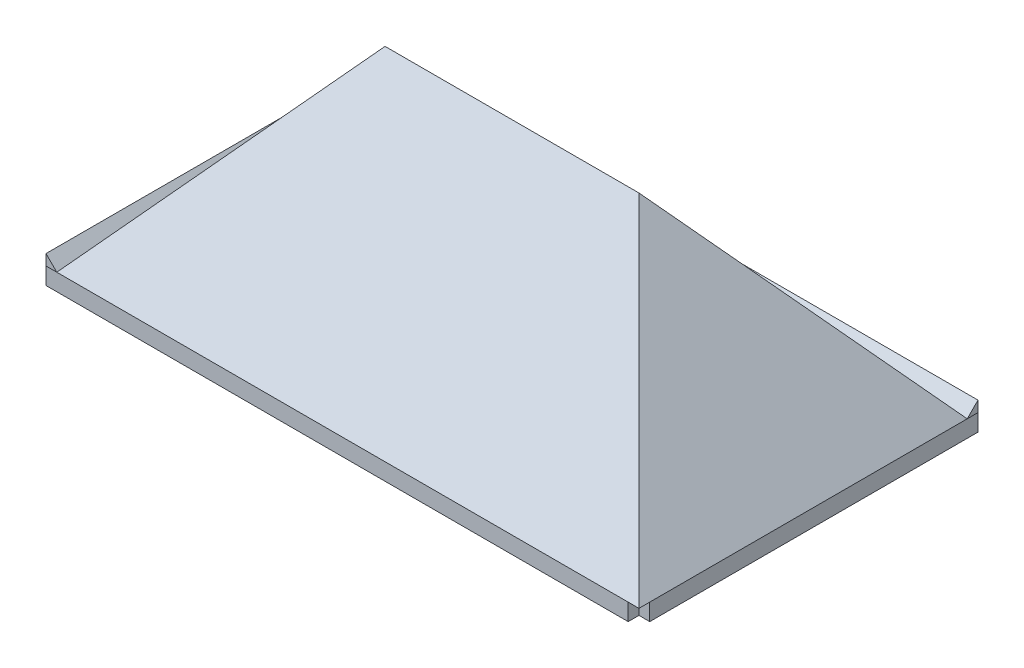
ISO-10303-21;
HEADER;
FILE_DESCRIPTION(('STEP AP214'),'2;1');
FILE_NAME('part.step','',(''),(''),'','','');
FILE_SCHEMA(('AUTOMOTIVE_DESIGN { 1 0 10303 214 1 1 1 1 }'));
ENDSEC;
DATA;
#1=APPLICATION_CONTEXT('core data for automotive mechanical design processes');
#2=APPLICATION_PROTOCOL_DEFINITION('international standard','automotive_design',2000,#1);
#3=PRODUCT_CONTEXT('',#1,'mechanical');
#4=PRODUCT('Part','Part','',(#3));
#5=PRODUCT_RELATED_PRODUCT_CATEGORY('part','',(#4));
#6=PRODUCT_DEFINITION_FORMATION('','',#4);
#7=PRODUCT_DEFINITION_CONTEXT('part definition',#1,'design');
#8=PRODUCT_DEFINITION('design','',#6,#7);
#9=PRODUCT_DEFINITION_SHAPE('','',#8);
#10=(LENGTH_UNIT() NAMED_UNIT(*) SI_UNIT(.MILLI.,.METRE.));
#11=(NAMED_UNIT(*) PLANE_ANGLE_UNIT() SI_UNIT($,.RADIAN.));
#12=(NAMED_UNIT(*) SI_UNIT($,.STERADIAN.) SOLID_ANGLE_UNIT());
#13=UNCERTAINTY_MEASURE_WITH_UNIT(LENGTH_MEASURE(1.E-05),#10,'distance_accuracy_value','');
#14=(GEOMETRIC_REPRESENTATION_CONTEXT(3) GLOBAL_UNCERTAINTY_ASSIGNED_CONTEXT((#13)) GLOBAL_UNIT_ASSIGNED_CONTEXT((#10,
#11,#12)) REPRESENTATION_CONTEXT('',''));
#15=CARTESIAN_POINT('',(0.,0.,0.));
#16=DIRECTION('',(0.,0.,1.));
#17=DIRECTION('',(1.,0.,0.));
#18=AXIS2_PLACEMENT_3D('',#15,#16,#17);
#19=CARTESIAN_POINT('',(105.,0.,120.));
#20=DIRECTION('',(0.,1.,0.));
#21=DIRECTION('',(-1.,0.,0.));
#22=AXIS2_PLACEMENT_3D('',#19,#20,#21);
#23=PLANE('',#22);
#24=DIRECTION('',(1.,0.,0.));
#25=VECTOR('',#24,1.);
#26=CARTESIAN_POINT('',(105.,0.,5.2216291573291));
#27=LINE('',#26,#25);
#28=CARTESIAN_POINT('',(-99.7783708426709,0.,5.2216291573291));
#29=VERTEX_POINT('',#28);
#30=CARTESIAN_POINT('',(99.7783708426709,0.,5.2216291573291));
#31=VERTEX_POINT('',#30);
#32=EDGE_CURVE('E195',#29,#31,#27,.T.);
#33=ORIENTED_EDGE('',*,*,#32,.F.);
#34=DIRECTION('',(0.,0.,-1.));
#35=VECTOR('',#34,1.);
#36=CARTESIAN_POINT('',(-99.7783708426709,0.,120.));
#37=LINE('',#36,#35);
#38=CARTESIAN_POINT('',(-99.7783708426709,0.,114.778370842671));
#39=VERTEX_POINT('',#38);
#40=EDGE_CURVE('E205',#39,#29,#37,.T.);
#41=ORIENTED_EDGE('',*,*,#40,.F.);
#42=DIRECTION('',(1.,0.,0.));
#43=VECTOR('',#42,1.);
#44=CARTESIAN_POINT('',(-150.,0.,114.778370842671));
#45=LINE('',#44,#43);
#46=CARTESIAN_POINT('',(99.7783708426709,0.,114.778370842671));
#47=VERTEX_POINT('',#46);
#48=EDGE_CURVE('E206',#39,#47,#45,.T.);
#49=ORIENTED_EDGE('',*,*,#48,.T.);
#50=DIRECTION('',(0.,0.,-1.));
#51=VECTOR('',#50,1.);
#52=CARTESIAN_POINT('',(99.7783708426709,0.,120.));
#53=LINE('',#52,#51);
#54=EDGE_CURVE('E201',#47,#31,#53,.T.);
#55=ORIENTED_EDGE('',*,*,#54,.T.);
#56=EDGE_LOOP('',(#33,#41,#49,#55));
#57=FACE_BOUND('',#56,.T.);
#58=DIRECTION('',(0.,0.,-1.));
#59=VECTOR('',#58,1.);
#60=CARTESIAN_POINT('',(-103.174977327052,0.,122.));
#61=LINE('',#60,#59);
#62=CARTESIAN_POINT('',(-103.174977327052,0.,122.));
#63=VERTEX_POINT('',#62);
#64=CARTESIAN_POINT('',(-103.174977327052,0.,118.174977327052));
#65=VERTEX_POINT('',#64);
#66=EDGE_CURVE('E47',#63,#65,#61,.T.);
#67=ORIENTED_EDGE('',*,*,#66,.T.);
#68=DIRECTION('',(-1.,0.,0.));
#69=VECTOR('',#68,1.);
#70=CARTESIAN_POINT('',(-107.,0.,118.174977327052));
#71=LINE('',#70,#69);
#72=CARTESIAN_POINT('',(-107.,0.,118.174977327052));
#73=VERTEX_POINT('',#72);
#74=EDGE_CURVE('E313',#65,#73,#71,.T.);
#75=ORIENTED_EDGE('',*,*,#74,.T.);
#76=DIRECTION('',(0.,0.,-1.));
#77=VECTOR('',#76,1.);
#78=CARTESIAN_POINT('',(-107.,0.,4.));
#79=LINE('',#78,#77);
#80=CARTESIAN_POINT('',(-107.,0.,1.82502267294814));
#81=VERTEX_POINT('',#80);
#82=EDGE_CURVE('E179',#73,#81,#79,.T.);
#83=ORIENTED_EDGE('',*,*,#82,.T.);
#84=DIRECTION('',(1.,0.,0.));
#85=VECTOR('',#84,1.);
#86=CARTESIAN_POINT('',(-107.,0.,1.82502267294814));
#87=LINE('',#86,#85);
#88=CARTESIAN_POINT('',(-103.174977327052,0.,1.82502267294814));
#89=VERTEX_POINT('',#88);
#90=EDGE_CURVE('E281',#81,#89,#87,.T.);
#91=ORIENTED_EDGE('',*,*,#90,.T.);
#92=DIRECTION('',(0.,0.,-1.));
#93=VECTOR('',#92,1.);
#94=CARTESIAN_POINT('',(-103.174977327052,0.,-2.));
#95=LINE('',#94,#93);
#96=CARTESIAN_POINT('',(-103.174977327052,0.,-2.));
#97=VERTEX_POINT('',#96);
#98=EDGE_CURVE('E278',#89,#97,#95,.T.);
#99=ORIENTED_EDGE('',*,*,#98,.T.);
#100=DIRECTION('',(1.,0.,0.));
#101=VECTOR('',#100,1.);
#102=CARTESIAN_POINT('',(-107.,0.,-2.));
#103=LINE('',#102,#101);
#104=CARTESIAN_POINT('',(103.174977327052,0.,-2.));
#105=VERTEX_POINT('',#104);
#106=EDGE_CURVE('E181',#97,#105,#103,.T.);
#107=ORIENTED_EDGE('',*,*,#106,.T.);
#108=DIRECTION('',(0.,0.,1.));
#109=VECTOR('',#108,1.);
#110=CARTESIAN_POINT('',(103.174977327052,0.,-2.));
#111=LINE('',#110,#109);
#112=CARTESIAN_POINT('',(103.174977327052,0.,1.82502267294814));
#113=VERTEX_POINT('',#112);
#114=EDGE_CURVE('E298',#105,#113,#111,.T.);
#115=ORIENTED_EDGE('',*,*,#114,.T.);
#116=DIRECTION('',(1.,0.,0.));
#117=VECTOR('',#116,1.);
#118=CARTESIAN_POINT('',(107.,0.,1.82502267294814));
#119=LINE('',#118,#117);
#120=CARTESIAN_POINT('',(107.,0.,1.82502267294814));
#121=VERTEX_POINT('',#120);
#122=EDGE_CURVE('E295',#113,#121,#119,.T.);
#123=ORIENTED_EDGE('',*,*,#122,.T.);
#124=DIRECTION('',(0.,0.,-1.));
#125=VECTOR('',#124,1.);
#126=CARTESIAN_POINT('',(107.,0.,4.));
#127=LINE('',#126,#125);
#128=CARTESIAN_POINT('',(107.,0.,118.174977327052));
#129=VERTEX_POINT('',#128);
#130=EDGE_CURVE('E171',#129,#121,#127,.T.);
#131=ORIENTED_EDGE('',*,*,#130,.F.);
#132=DIRECTION('',(-1.,0.,0.));
#133=VECTOR('',#132,1.);
#134=CARTESIAN_POINT('',(107.,0.,118.174977327052));
#135=LINE('',#134,#133);
#136=CARTESIAN_POINT('',(103.174977327052,0.,118.174977327052));
#137=VERTEX_POINT('',#136);
#138=EDGE_CURVE('E290',#129,#137,#135,.T.);
#139=ORIENTED_EDGE('',*,*,#138,.T.);
#140=DIRECTION('',(0.,0.,1.));
#141=VECTOR('',#140,1.);
#142=CARTESIAN_POINT('',(103.174977327052,0.,122.));
#143=LINE('',#142,#141);
#144=CARTESIAN_POINT('',(103.174977327052,0.,122.));
#145=VERTEX_POINT('',#144);
#146=EDGE_CURVE('E305',#137,#145,#143,.T.);
#147=ORIENTED_EDGE('',*,*,#146,.T.);
#148=DIRECTION('',(1.,0.,0.));
#149=VECTOR('',#148,1.);
#150=CARTESIAN_POINT('',(-107.,0.,122.));
#151=LINE('',#150,#149);
#152=EDGE_CURVE('E168',#63,#145,#151,.T.);
#153=ORIENTED_EDGE('',*,*,#152,.F.);
#154=EDGE_LOOP('',(#67,#75,#83,#91,#99,#107,#115,#123,#131,#139,#147,#153));
#155=FACE_BOUND('',#154,.T.);
#156=ADVANCED_FACE('F33',(#57,#155),#23,.F.);
#157=CARTESIAN_POINT('',(-107.,6.,-2.));
#158=DIRECTION('',(0.,0.707106781186547,0.707106781186547));
#159=DIRECTION('',(0.,-0.707106781186548,0.707106781186548));
#160=AXIS2_PLACEMENT_3D('',#157,#158,#159);
#161=PLANE('',#160);
#162=DIRECTION('',(-1.,0.,0.));
#163=VECTOR('',#162,1.);
#164=CARTESIAN_POINT('',(-150.,2.17497732705187,1.82502267294814));
#165=LINE('',#164,#163);
#166=CARTESIAN_POINT('',(103.174977327052,2.17497732705185,1.82502267294814));
#167=VERTEX_POINT('',#166);
#168=CARTESIAN_POINT('',(-103.174977327052,2.1749773270518,1.82502267294814));
#169=VERTEX_POINT('',#168);
#170=EDGE_CURVE('E225',#167,#169,#165,.T.);
#171=ORIENTED_EDGE('',*,*,#170,.F.);
#172=DIRECTION('',(0.,0.707106781186548,-0.707106781186548));
#173=VECTOR('',#172,1.);
#174=CARTESIAN_POINT('',(103.174977327052,6.,-2.));
#175=LINE('',#174,#173);
#176=CARTESIAN_POINT('',(103.174977327052,6.,-2.));
#177=VERTEX_POINT('',#176);
#178=EDGE_CURVE('E150',#167,#177,#175,.T.);
#179=ORIENTED_EDGE('',*,*,#178,.T.);
#180=DIRECTION('',(1.,0.,0.));
#181=VECTOR('',#180,1.);
#182=CARTESIAN_POINT('',(-107.,6.,-2.));
#183=LINE('',#182,#181);
#184=CARTESIAN_POINT('',(-103.174977327052,6.,-2.));
#185=VERTEX_POINT('',#184);
#186=EDGE_CURVE('E182',#185,#177,#183,.T.);
#187=ORIENTED_EDGE('',*,*,#186,.F.);
#188=DIRECTION('',(0.,-0.707106781186548,0.707106781186548));
#189=VECTOR('',#188,1.);
#190=CARTESIAN_POINT('',(-103.174977327052,6.,-2.));
#191=LINE('',#190,#189);
#192=EDGE_CURVE('E250',#185,#169,#191,.T.);
#193=ORIENTED_EDGE('',*,*,#192,.T.);
#194=EDGE_LOOP('',(#171,#179,#187,#193));
#195=FACE_BOUND('',#194,.T.);
#196=ADVANCED_FACE('F247',(#195),#161,.T.);
#197=CARTESIAN_POINT('',(-107.,0.,-2.));
#198=DIRECTION('',(0.,0.,-1.));
#199=DIRECTION('',(0.,1.,0.));
#200=AXIS2_PLACEMENT_3D('',#197,#198,#199);
#201=PLANE('',#200);
#202=ORIENTED_EDGE('',*,*,#186,.T.);
#203=DIRECTION('',(0.,-1.,0.));
#204=VECTOR('',#203,1.);
#205=CARTESIAN_POINT('',(103.174977327052,6.,-2.));
#206=LINE('',#205,#204);
#207=EDGE_CURVE('E287',#177,#105,#206,.T.);
#208=ORIENTED_EDGE('',*,*,#207,.T.);
#209=ORIENTED_EDGE('',*,*,#106,.F.);
#210=DIRECTION('',(0.,-1.,0.));
#211=VECTOR('',#210,1.);
#212=CARTESIAN_POINT('',(-103.174977327052,6.,-2.));
#213=LINE('',#212,#211);
#214=EDGE_CURVE('E276',#185,#97,#213,.T.);
#215=ORIENTED_EDGE('',*,*,#214,.F.);
#216=EDGE_LOOP('',(#202,#208,#209,#215));
#217=FACE_BOUND('',#216,.T.);
#218=ADVANCED_FACE('F333',(#217),#201,.T.);
#219=CARTESIAN_POINT('',(-107.,0.,0.));
#220=DIRECTION('',(1.,0.,0.));
#221=DIRECTION('',(0.,0.,-1.));
#222=AXIS2_PLACEMENT_3D('',#219,#220,#221);
#223=PLANE('',#222);
#224=DIRECTION('',(0.,-1.,0.));
#225=VECTOR('',#224,1.);
#226=CARTESIAN_POINT('',(-107.,6.,118.174977327052));
#227=LINE('',#226,#225);
#228=CARTESIAN_POINT('',(-107.,6.,118.174977327052));
#229=VERTEX_POINT('',#228);
#230=EDGE_CURVE('E311',#229,#73,#227,.T.);
#231=ORIENTED_EDGE('',*,*,#230,.F.);
#232=DIRECTION('',(0.,0.,1.));
#233=VECTOR('',#232,1.);
#234=CARTESIAN_POINT('',(-107.,5.99999999999999,-2.));
#235=LINE('',#234,#233);
#236=CARTESIAN_POINT('',(-107.,5.99999999999999,1.82502267294814));
#237=VERTEX_POINT('',#236);
#238=EDGE_CURVE('E264',#237,#229,#235,.T.);
#239=ORIENTED_EDGE('',*,*,#238,.F.);
#240=DIRECTION('',(0.,-1.,0.));
#241=VECTOR('',#240,1.);
#242=CARTESIAN_POINT('',(-107.,6.,1.82502267294814));
#243=LINE('',#242,#241);
#244=EDGE_CURVE('E271',#237,#81,#243,.T.);
#245=ORIENTED_EDGE('',*,*,#244,.T.);
#246=ORIENTED_EDGE('',*,*,#82,.F.);
#247=EDGE_LOOP('',(#231,#239,#245,#246));
#248=FACE_BOUND('',#247,.T.);
#249=ADVANCED_FACE('F345',(#248),#223,.F.);
#250=CARTESIAN_POINT('',(-107.,5.99999999999999,-2.));
#251=DIRECTION('',(0.707106781186547,0.707106781186548,0.));
#252=DIRECTION('',(-0.707106781186548,0.707106781186547,0.));
#253=AXIS2_PLACEMENT_3D('',#250,#251,#252);
#254=PLANE('',#253);
#255=ORIENTED_EDGE('',*,*,#238,.T.);
#256=DIRECTION('',(0.707106781186548,-0.707106781186547,0.));
#257=VECTOR('',#256,1.);
#258=CARTESIAN_POINT('',(-107.,5.99999999999999,118.174977327052));
#259=LINE('',#258,#257);
#260=CARTESIAN_POINT('',(-103.174977327052,2.17497732705182,118.174977327052));
#261=VERTEX_POINT('',#260);
#262=EDGE_CURVE('E162',#229,#261,#259,.T.);
#263=ORIENTED_EDGE('',*,*,#262,.T.);
#264=DIRECTION('',(0.,0.,1.));
#265=VECTOR('',#264,1.);
#266=CARTESIAN_POINT('',(-103.174977327052,2.17497732705183,120.));
#267=LINE('',#266,#265);
#268=EDGE_CURVE('E261',#169,#261,#267,.T.);
#269=ORIENTED_EDGE('',*,*,#268,.F.);
#270=DIRECTION('',(-0.707106781186548,0.707106781186547,0.));
#271=VECTOR('',#270,1.);
#272=CARTESIAN_POINT('',(-107.,5.99999999999999,1.82502267294814));
#273=LINE('',#272,#271);
#274=EDGE_CURVE('E229',#169,#237,#273,.T.);
#275=ORIENTED_EDGE('',*,*,#274,.T.);
#276=EDGE_LOOP('',(#255,#263,#269,#275));
#277=FACE_BOUND('',#276,.T.);
#278=ADVANCED_FACE('F346',(#277),#254,.T.);
#279=CARTESIAN_POINT('',(107.,0.,0.));
#280=DIRECTION('',(1.,0.,0.));
#281=DIRECTION('',(0.,0.,-1.));
#282=AXIS2_PLACEMENT_3D('',#279,#280,#281);
#283=PLANE('',#282);
#284=DIRECTION('',(0.,0.,1.));
#285=VECTOR('',#284,1.);
#286=CARTESIAN_POINT('',(107.,6.,-2.));
#287=LINE('',#286,#285);
#288=CARTESIAN_POINT('',(107.,6.,1.82502267294814));
#289=VERTEX_POINT('',#288);
#290=CARTESIAN_POINT('',(107.,6.,118.174977327052));
#291=VERTEX_POINT('',#290);
#292=EDGE_CURVE('E174',#289,#291,#287,.T.);
#293=ORIENTED_EDGE('',*,*,#292,.T.);
#294=DIRECTION('',(0.,-1.,0.));
#295=VECTOR('',#294,1.);
#296=CARTESIAN_POINT('',(107.,6.,118.174977327052));
#297=LINE('',#296,#295);
#298=EDGE_CURVE('E55',#291,#129,#297,.T.);
#299=ORIENTED_EDGE('',*,*,#298,.T.);
#300=ORIENTED_EDGE('',*,*,#130,.T.);
#301=DIRECTION('',(0.,-1.,0.));
#302=VECTOR('',#301,1.);
#303=CARTESIAN_POINT('',(107.,6.,1.82502267294814));
#304=LINE('',#303,#302);
#305=EDGE_CURVE('E293',#289,#121,#304,.T.);
#306=ORIENTED_EDGE('',*,*,#305,.F.);
#307=EDGE_LOOP('',(#293,#299,#300,#306));
#308=FACE_BOUND('',#307,.T.);
#309=ADVANCED_FACE('F326',(#308),#283,.T.);
#310=CARTESIAN_POINT('',(-107.,0.,116.));
#311=DIRECTION('',(0.,0.707106781186548,-0.707106781186547));
#312=DIRECTION('',(0.,0.707106781186547,0.707106781186548));
#313=AXIS2_PLACEMENT_3D('',#310,#311,#312);
#314=PLANE('',#313);
#315=DIRECTION('',(1.,0.,0.));
#316=VECTOR('',#315,1.);
#317=CARTESIAN_POINT('',(-150.,2.17497732705185,118.174977327052));
#318=LINE('',#317,#316);
#319=CARTESIAN_POINT('',(103.174977327052,2.17497732705188,118.174977327052));
#320=VERTEX_POINT('',#319);
#321=EDGE_CURVE('E160',#261,#320,#318,.T.);
#322=ORIENTED_EDGE('',*,*,#321,.F.);
#323=DIRECTION('',(0.,0.707106781186547,0.707106781186548));
#324=VECTOR('',#323,1.);
#325=CARTESIAN_POINT('',(-103.174977327052,0.,116.));
#326=LINE('',#325,#324);
#327=CARTESIAN_POINT('',(-103.174977327052,6.,122.));
#328=VERTEX_POINT('',#327);
#329=EDGE_CURVE('E144',#261,#328,#326,.T.);
#330=ORIENTED_EDGE('',*,*,#329,.T.);
#331=DIRECTION('',(1.,0.,0.));
#332=VECTOR('',#331,1.);
#333=CARTESIAN_POINT('',(-107.,5.99999999999999,122.));
#334=LINE('',#333,#332);
#335=CARTESIAN_POINT('',(103.174977327052,6.,122.));
#336=VERTEX_POINT('',#335);
#337=EDGE_CURVE('E158',#328,#336,#334,.T.);
#338=ORIENTED_EDGE('',*,*,#337,.T.);
#339=DIRECTION('',(0.,-0.707106781186547,-0.707106781186548));
#340=VECTOR('',#339,1.);
#341=CARTESIAN_POINT('',(103.174977327052,0.,116.));
#342=LINE('',#341,#340);
#343=EDGE_CURVE('E163',#336,#320,#342,.T.);
#344=ORIENTED_EDGE('',*,*,#343,.T.);
#345=EDGE_LOOP('',(#322,#330,#338,#344));
#346=FACE_BOUND('',#345,.T.);
#347=ADVANCED_FACE('F156',(#346),#314,.T.);
#348=CARTESIAN_POINT('',(-107.,0.,122.));
#349=DIRECTION('',(0.,0.,1.));
#350=DIRECTION('',(1.,0.,0.));
#351=AXIS2_PLACEMENT_3D('',#348,#349,#350);
#352=PLANE('',#351);
#353=ORIENTED_EDGE('',*,*,#337,.F.);
#354=DIRECTION('',(0.,-1.,0.));
#355=VECTOR('',#354,1.);
#356=CARTESIAN_POINT('',(-103.174977327052,6.,122.));
#357=LINE('',#356,#355);
#358=EDGE_CURVE('E141',#328,#63,#357,.T.);
#359=ORIENTED_EDGE('',*,*,#358,.T.);
#360=ORIENTED_EDGE('',*,*,#152,.T.);
#361=DIRECTION('',(0.,-1.,0.));
#362=VECTOR('',#361,1.);
#363=CARTESIAN_POINT('',(103.174977327052,6.,122.));
#364=LINE('',#363,#362);
#365=EDGE_CURVE('E167',#336,#145,#364,.T.);
#366=ORIENTED_EDGE('',*,*,#365,.F.);
#367=EDGE_LOOP('',(#353,#359,#360,#366));
#368=FACE_BOUND('',#367,.T.);
#369=ADVANCED_FACE('F166',(#368),#352,.T.);
#370=CARTESIAN_POINT('',(107.,6.,-2.));
#371=DIRECTION('',(-0.707106781186547,0.707106781186548,0.));
#372=DIRECTION('',(-0.707106781186548,-0.707106781186547,0.));
#373=AXIS2_PLACEMENT_3D('',#370,#371,#372);
#374=PLANE('',#373);
#375=DIRECTION('',(0.,0.,-1.));
#376=VECTOR('',#375,1.);
#377=CARTESIAN_POINT('',(103.174977327052,2.17497732705185,120.));
#378=LINE('',#377,#376);
#379=EDGE_CURVE('E169',#320,#167,#378,.T.);
#380=ORIENTED_EDGE('',*,*,#379,.F.);
#381=DIRECTION('',(0.707106781186548,0.707106781186547,0.));
#382=VECTOR('',#381,1.);
#383=CARTESIAN_POINT('',(107.,6.,118.174977327052));
#384=LINE('',#383,#382);
#385=EDGE_CURVE('E11',#320,#291,#384,.T.);
#386=ORIENTED_EDGE('',*,*,#385,.T.);
#387=ORIENTED_EDGE('',*,*,#292,.F.);
#388=DIRECTION('',(-0.707106781186548,-0.707106781186547,0.));
#389=VECTOR('',#388,1.);
#390=CARTESIAN_POINT('',(107.,6.,1.82502267294814));
#391=LINE('',#390,#389);
#392=EDGE_CURVE('E40',#289,#167,#391,.T.);
#393=ORIENTED_EDGE('',*,*,#392,.T.);
#394=EDGE_LOOP('',(#380,#386,#387,#393));
#395=FACE_BOUND('',#394,.T.);
#396=ADVANCED_FACE('F235',(#395),#374,.T.);
#397=CARTESIAN_POINT('',(0.,125.134127222392,120.));
#398=DIRECTION('',(-0.766044443118977,-0.64278760968654,0.));
#399=DIRECTION('',(0.64278760968654,-0.766044443118977,0.));
#400=AXIS2_PLACEMENT_3D('',#397,#398,#399);
#401=PLANE('',#400);
#402=DIRECTION('',(0.54071620306094,-0.644400477571773,0.540716203060932));
#403=VECTOR('',#402,1.);
#404=CARTESIAN_POINT('',(30.6992712865262,88.5481603766499,45.6992712865273));
#405=LINE('',#404,#403);
#406=CARTESIAN_POINT('',(44.9999999999991,71.5052155556534,60.));
#407=VERTEX_POINT('',#406);
#408=EDGE_CURVE('E222',#407,#320,#405,.T.);
#409=ORIENTED_EDGE('',*,*,#408,.T.);
#410=ORIENTED_EDGE('',*,*,#379,.T.);
#411=DIRECTION('',(-0.54071620306094,0.644400477571773,0.540716203060932));
#412=VECTOR('',#411,1.);
#413=CARTESIAN_POINT('',(-4.38561018378998,130.360693914641,109.385610183788));
#414=LINE('',#413,#412);
#415=EDGE_CURVE('E218',#167,#407,#414,.T.);
#416=ORIENTED_EDGE('',*,*,#415,.T.);
#417=EDGE_LOOP('',(#409,#410,#416));
#418=FACE_BOUND('',#417,.T.);
#419=ADVANCED_FACE('F241',(#418),#401,.F.);
#420=CARTESIAN_POINT('',(-105.,0.,120.));
#421=DIRECTION('',(0.766044443118977,-0.64278760968654,0.));
#422=DIRECTION('',(0.64278760968654,0.766044443118977,0.));
#423=AXIS2_PLACEMENT_3D('',#420,#421,#422);
#424=PLANE('',#423);
#425=DIRECTION('',(-0.54071620306094,-0.644400477571773,-0.540716203060932));
#426=VECTOR('',#425,1.);
#427=CARTESIAN_POINT('',(-69.9151185296838,41.8125335379913,35.0848814703157));
#428=LINE('',#427,#426);
#429=CARTESIAN_POINT('',(-44.9999999999991,71.5052155556534,60.));
#430=VERTEX_POINT('',#429);
#431=EDGE_CURVE('E215',#430,#169,#428,.T.);
#432=ORIENTED_EDGE('',*,*,#431,.T.);
#433=ORIENTED_EDGE('',*,*,#268,.T.);
#434=DIRECTION('',(0.54071620306094,0.644400477571773,-0.540716203060932));
#435=VECTOR('',#434,1.);
#436=CARTESIAN_POINT('',(-105.,0.,120.));
#437=LINE('',#436,#435);
#438=EDGE_CURVE('E220',#261,#430,#437,.T.);
#439=ORIENTED_EDGE('',*,*,#438,.T.);
#440=EDGE_LOOP('',(#432,#433,#439));
#441=FACE_BOUND('',#440,.T.);
#442=ADVANCED_FACE('F259',(#441),#424,.F.);
#443=CARTESIAN_POINT('',(-150.,0.,120.));
#444=DIRECTION('',(0.,-0.642787609686535,-0.766044443118982));
#445=DIRECTION('',(0.,0.766044443118982,-0.642787609686535));
#446=AXIS2_PLACEMENT_3D('',#443,#444,#445);
#447=PLANE('',#446);
#448=ORIENTED_EDGE('',*,*,#438,.F.);
#449=ORIENTED_EDGE('',*,*,#321,.T.);
#450=ORIENTED_EDGE('',*,*,#408,.F.);
#451=DIRECTION('',(1.,0.,0.));
#452=VECTOR('',#451,1.);
#453=CARTESIAN_POINT('',(-150.,71.5052155556534,60.));
#454=LINE('',#453,#452);
#455=EDGE_CURVE('E204',#430,#407,#454,.T.);
#456=ORIENTED_EDGE('',*,*,#455,.F.);
#457=EDGE_LOOP('',(#448,#449,#450,#456));
#458=FACE_BOUND('',#457,.T.);
#459=ADVANCED_FACE('F257',(#458),#447,.F.);
#460=CARTESIAN_POINT('',(-150.,71.5052155556534,60.));
#461=DIRECTION('',(0.,-0.642787609686535,0.766044443118982));
#462=DIRECTION('',(0.,-0.766044443118982,-0.642787609686535));
#463=AXIS2_PLACEMENT_3D('',#460,#461,#462);
#464=PLANE('',#463);
#465=ORIENTED_EDGE('',*,*,#415,.F.);
#466=ORIENTED_EDGE('',*,*,#170,.T.);
#467=ORIENTED_EDGE('',*,*,#431,.F.);
#468=ORIENTED_EDGE('',*,*,#455,.T.);
#469=EDGE_LOOP('',(#465,#466,#467,#468));
#470=FACE_BOUND('',#469,.T.);
#471=ADVANCED_FACE('F253',(#470),#464,.F.);
#472=CARTESIAN_POINT('',(-3.06417777247592,122.562976783646,120.));
#473=DIRECTION('',(-0.766044443118977,-0.64278760968654,0.));
#474=DIRECTION('',(0.64278760968654,-0.766044443118977,0.));
#475=AXIS2_PLACEMENT_3D('',#472,#473,#474);
#476=PLANE('',#475);
#477=ORIENTED_EDGE('',*,*,#54,.F.);
#478=DIRECTION('',(0.54071620306094,-0.644400477571773,0.540716203060932));
#479=VECTOR('',#478,1.);
#480=CARTESIAN_POINT('',(28.5309794636444,84.9093346389202,43.5309794636455));
#481=LINE('',#480,#479);
#482=CARTESIAN_POINT('',(44.9999999999992,65.2823202482117,60.));
#483=VERTEX_POINT('',#482);
#484=EDGE_CURVE('E193',#483,#47,#481,.T.);
#485=ORIENTED_EDGE('',*,*,#484,.F.);
#486=DIRECTION('',(-0.54071620306094,0.644400477571773,0.540716203060932));
#487=VECTOR('',#486,1.);
#488=CARTESIAN_POINT('',(-6.55390200667176,126.721868176911,111.55390200667));
#489=LINE('',#488,#487);
#490=EDGE_CURVE('E188',#31,#483,#489,.T.);
#491=ORIENTED_EDGE('',*,*,#490,.F.);
#492=EDGE_LOOP('',(#477,#485,#491));
#493=FACE_BOUND('',#492,.T.);
#494=ADVANCED_FACE('F374',(#493),#476,.T.);
#495=CARTESIAN_POINT('',(-101.935822227524,-2.57115043874617,120.));
#496=DIRECTION('',(0.766044443118977,-0.64278760968654,0.));
#497=DIRECTION('',(0.64278760968654,0.766044443118977,0.));
#498=AXIS2_PLACEMENT_3D('',#495,#496,#497);
#499=PLANE('',#498);
#500=DIRECTION('',(0.54071620306094,0.644400477571773,-0.540716203060932));
#501=VECTOR('',#500,1.);
#502=CARTESIAN_POINT('',(-102.831708177118,-3.63882573772964,117.831708177118));
#503=LINE('',#502,#501);
#504=CARTESIAN_POINT('',(-44.9999999999992,65.2823202482117,60.));
#505=VERTEX_POINT('',#504);
#506=EDGE_CURVE('E191',#39,#505,#503,.T.);
#507=ORIENTED_EDGE('',*,*,#506,.F.);
#508=ORIENTED_EDGE('',*,*,#40,.T.);
#509=DIRECTION('',(-0.54071620306094,-0.644400477571773,-0.540716203060932));
#510=VECTOR('',#509,1.);
#511=CARTESIAN_POINT('',(-67.746826706802,38.1737078002616,37.2531732931975));
#512=LINE('',#511,#510);
#513=EDGE_CURVE('E192',#505,#29,#512,.T.);
#514=ORIENTED_EDGE('',*,*,#513,.F.);
#515=EDGE_LOOP('',(#507,#508,#514));
#516=FACE_BOUND('',#515,.T.);
#517=ADVANCED_FACE('F370',(#516),#499,.T.);
#518=CARTESIAN_POINT('',(-150.,-2.57115043874614,116.935822227524));
#519=DIRECTION('',(0.,-0.642787609686535,-0.766044443118982));
#520=DIRECTION('',(0.,0.766044443118982,-0.642787609686535));
#521=AXIS2_PLACEMENT_3D('',#518,#519,#520);
#522=PLANE('',#521);
#523=DIRECTION('',(1.,0.,0.));
#524=VECTOR('',#523,1.);
#525=CARTESIAN_POINT('',(-150.,65.2823202482117,60.));
#526=LINE('',#525,#524);
#527=EDGE_CURVE('E185',#505,#483,#526,.T.);
#528=ORIENTED_EDGE('',*,*,#527,.T.);
#529=ORIENTED_EDGE('',*,*,#484,.T.);
#530=ORIENTED_EDGE('',*,*,#48,.F.);
#531=ORIENTED_EDGE('',*,*,#506,.T.);
#532=EDGE_LOOP('',(#528,#529,#530,#531));
#533=FACE_BOUND('',#532,.T.);
#534=ADVANCED_FACE('F372',(#533),#522,.T.);
#535=CARTESIAN_POINT('',(-150.,68.9340651169073,63.0641777724759));
#536=DIRECTION('',(0.,-0.642787609686535,0.766044443118982));
#537=DIRECTION('',(0.,-0.766044443118982,-0.642787609686535));
#538=AXIS2_PLACEMENT_3D('',#535,#536,#537);
#539=PLANE('',#538);
#540=ORIENTED_EDGE('',*,*,#32,.T.);
#541=ORIENTED_EDGE('',*,*,#490,.T.);
#542=ORIENTED_EDGE('',*,*,#527,.F.);
#543=ORIENTED_EDGE('',*,*,#513,.T.);
#544=EDGE_LOOP('',(#540,#541,#542,#543));
#545=FACE_BOUND('',#544,.T.);
#546=ADVANCED_FACE('F366',(#545),#539,.T.);
#547=CARTESIAN_POINT('',(-107.,6.,1.82502267294814));
#548=DIRECTION('',(0.,0.,-1.));
#549=DIRECTION('',(-1.,0.,0.));
#550=AXIS2_PLACEMENT_3D('',#547,#548,#549);
#551=PLANE('',#550);
#552=DIRECTION('',(0.,-1.,0.));
#553=VECTOR('',#552,1.);
#554=CARTESIAN_POINT('',(-103.174977327052,6.,1.82502267294814));
#555=LINE('',#554,#553);
#556=EDGE_CURVE('E274',#169,#89,#555,.T.);
#557=ORIENTED_EDGE('',*,*,#556,.T.);
#558=ORIENTED_EDGE('',*,*,#90,.F.);
#559=ORIENTED_EDGE('',*,*,#244,.F.);
#560=ORIENTED_EDGE('',*,*,#274,.F.);
#561=EDGE_LOOP('',(#557,#558,#559,#560));
#562=FACE_BOUND('',#561,.T.);
#563=ADVANCED_FACE('F341',(#562),#551,.T.);
#564=CARTESIAN_POINT('',(-103.174977327052,6.,-2.));
#565=DIRECTION('',(-1.,0.,0.));
#566=DIRECTION('',(0.,0.,1.));
#567=AXIS2_PLACEMENT_3D('',#564,#565,#566);
#568=PLANE('',#567);
#569=ORIENTED_EDGE('',*,*,#214,.T.);
#570=ORIENTED_EDGE('',*,*,#98,.F.);
#571=ORIENTED_EDGE('',*,*,#556,.F.);
#572=ORIENTED_EDGE('',*,*,#192,.F.);
#573=EDGE_LOOP('',(#569,#570,#571,#572));
#574=FACE_BOUND('',#573,.T.);
#575=ADVANCED_FACE('F337',(#574),#568,.T.);
#576=CARTESIAN_POINT('',(103.174977327052,6.,-2.));
#577=DIRECTION('',(1.,0.,0.));
#578=DIRECTION('',(0.,0.,-1.));
#579=AXIS2_PLACEMENT_3D('',#576,#577,#578);
#580=PLANE('',#579);
#581=DIRECTION('',(0.,-1.,0.));
#582=VECTOR('',#581,1.);
#583=CARTESIAN_POINT('',(103.174977327052,6.,1.82502267294814));
#584=LINE('',#583,#582);
#585=EDGE_CURVE('E291',#167,#113,#584,.T.);
#586=ORIENTED_EDGE('',*,*,#585,.T.);
#587=ORIENTED_EDGE('',*,*,#114,.F.);
#588=ORIENTED_EDGE('',*,*,#207,.F.);
#589=ORIENTED_EDGE('',*,*,#178,.F.);
#590=EDGE_LOOP('',(#586,#587,#588,#589));
#591=FACE_BOUND('',#590,.T.);
#592=ADVANCED_FACE('F331',(#591),#580,.T.);
#593=CARTESIAN_POINT('',(107.,6.,1.82502267294814));
#594=DIRECTION('',(0.,0.,-1.));
#595=DIRECTION('',(-1.,0.,0.));
#596=AXIS2_PLACEMENT_3D('',#593,#594,#595);
#597=PLANE('',#596);
#598=ORIENTED_EDGE('',*,*,#305,.T.);
#599=ORIENTED_EDGE('',*,*,#122,.F.);
#600=ORIENTED_EDGE('',*,*,#585,.F.);
#601=ORIENTED_EDGE('',*,*,#392,.F.);
#602=EDGE_LOOP('',(#598,#599,#600,#601));
#603=FACE_BOUND('',#602,.T.);
#604=ADVANCED_FACE('F328',(#603),#597,.T.);
#605=CARTESIAN_POINT('',(107.,6.,118.174977327052));
#606=DIRECTION('',(0.,0.,1.));
#607=DIRECTION('',(1.,0.,0.));
#608=AXIS2_PLACEMENT_3D('',#605,#606,#607);
#609=PLANE('',#608);
#610=DIRECTION('',(0.,-1.,0.));
#611=VECTOR('',#610,1.);
#612=CARTESIAN_POINT('',(103.174977327052,6.,118.174977327052));
#613=LINE('',#612,#611);
#614=EDGE_CURVE('E302',#320,#137,#613,.T.);
#615=ORIENTED_EDGE('',*,*,#614,.T.);
#616=ORIENTED_EDGE('',*,*,#138,.F.);
#617=ORIENTED_EDGE('',*,*,#298,.F.);
#618=ORIENTED_EDGE('',*,*,#385,.F.);
#619=EDGE_LOOP('',(#615,#616,#617,#618));
#620=FACE_BOUND('',#619,.T.);
#621=ADVANCED_FACE('F324',(#620),#609,.T.);
#622=CARTESIAN_POINT('',(103.174977327052,6.,122.));
#623=DIRECTION('',(1.,0.,0.));
#624=DIRECTION('',(0.,0.,-1.));
#625=AXIS2_PLACEMENT_3D('',#622,#623,#624);
#626=PLANE('',#625);
#627=ORIENTED_EDGE('',*,*,#365,.T.);
#628=ORIENTED_EDGE('',*,*,#146,.F.);
#629=ORIENTED_EDGE('',*,*,#614,.F.);
#630=ORIENTED_EDGE('',*,*,#343,.F.);
#631=EDGE_LOOP('',(#627,#628,#629,#630));
#632=FACE_BOUND('',#631,.T.);
#633=ADVANCED_FACE('F323',(#632),#626,.T.);
#634=CARTESIAN_POINT('',(-103.174977327052,6.,122.));
#635=DIRECTION('',(-1.,0.,0.));
#636=DIRECTION('',(0.,0.,1.));
#637=AXIS2_PLACEMENT_3D('',#634,#635,#636);
#638=PLANE('',#637);
#639=DIRECTION('',(0.,-1.,0.));
#640=VECTOR('',#639,1.);
#641=CARTESIAN_POINT('',(-103.174977327052,6.,118.174977327052));
#642=LINE('',#641,#640);
#643=EDGE_CURVE('E151',#261,#65,#642,.T.);
#644=ORIENTED_EDGE('',*,*,#643,.T.);
#645=ORIENTED_EDGE('',*,*,#66,.F.);
#646=ORIENTED_EDGE('',*,*,#358,.F.);
#647=ORIENTED_EDGE('',*,*,#329,.F.);
#648=EDGE_LOOP('',(#644,#645,#646,#647));
#649=FACE_BOUND('',#648,.T.);
#650=ADVANCED_FACE('F143',(#649),#638,.T.);
#651=CARTESIAN_POINT('',(-107.,6.,118.174977327052));
#652=DIRECTION('',(0.,0.,1.));
#653=DIRECTION('',(1.,0.,0.));
#654=AXIS2_PLACEMENT_3D('',#651,#652,#653);
#655=PLANE('',#654);
#656=ORIENTED_EDGE('',*,*,#230,.T.);
#657=ORIENTED_EDGE('',*,*,#74,.F.);
#658=ORIENTED_EDGE('',*,*,#643,.F.);
#659=ORIENTED_EDGE('',*,*,#262,.F.);
#660=EDGE_LOOP('',(#656,#657,#658,#659));
#661=FACE_BOUND('',#660,.T.);
#662=ADVANCED_FACE('F348',(#661),#655,.T.);
#663=CLOSED_SHELL('',(#156,#196,#218,#249,#278,#309,#347,#369,#396,#419,#442,#459,#471,#494,
#517,#534,#546,#563,#575,#592,#604,#621,#633,#650,#662));
#664=MANIFOLD_SOLID_BREP('B2',#663);
#665=ADVANCED_BREP_SHAPE_REPRESENTATION('',(#18,#664),#14);
#666=SHAPE_DEFINITION_REPRESENTATION(#9,#665);
ENDSEC;
END-ISO-10303-21;
